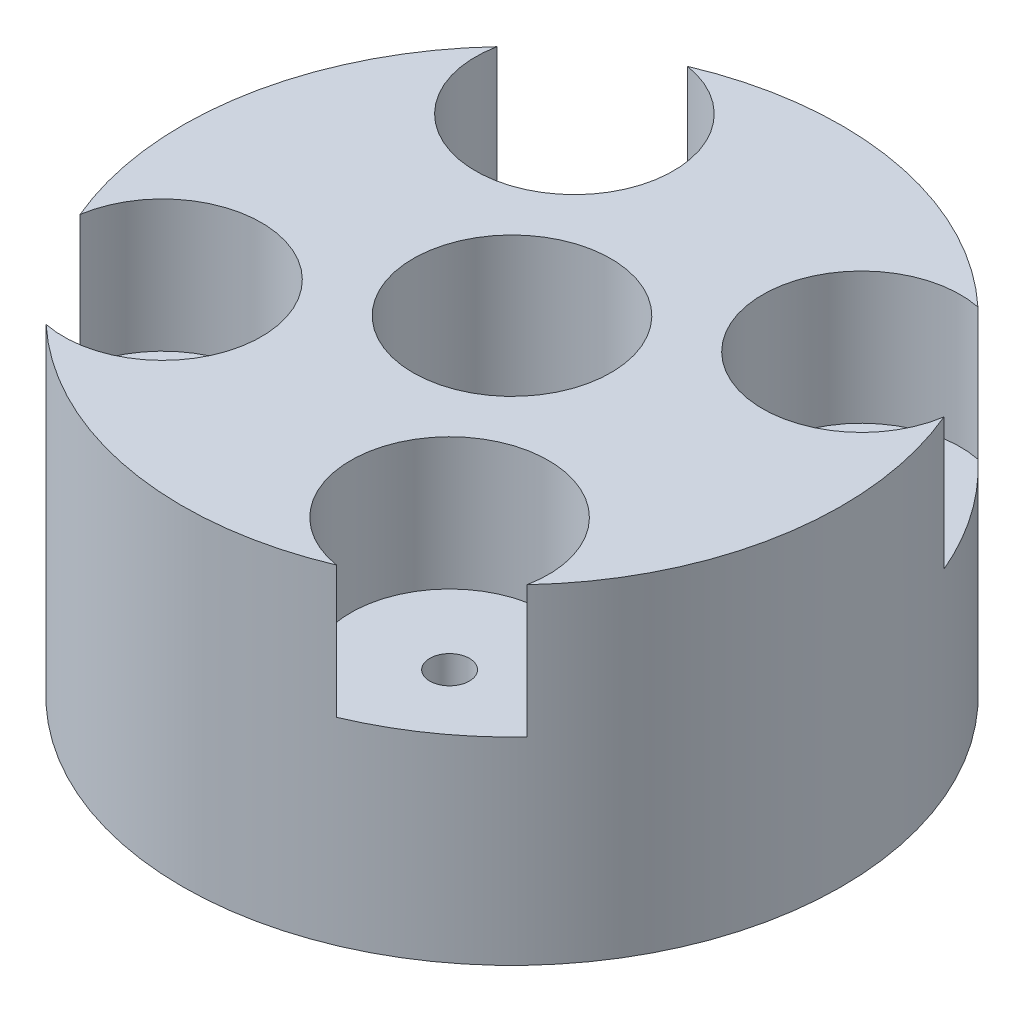
ISO-10303-21;
HEADER;
FILE_DESCRIPTION(('STEP AP214'),'2;1');
FILE_NAME('part.step','',(''),(''),'','','');
FILE_SCHEMA(('AUTOMOTIVE_DESIGN { 1 0 10303 214 1 1 1 1 }'));
ENDSEC;
DATA;
#1=APPLICATION_CONTEXT('core data for automotive mechanical design processes');
#2=APPLICATION_PROTOCOL_DEFINITION('international standard','automotive_design',2000,#1);
#3=PRODUCT_CONTEXT('',#1,'mechanical');
#4=PRODUCT('Part','Part','',(#3));
#5=PRODUCT_RELATED_PRODUCT_CATEGORY('part','',(#4));
#6=PRODUCT_DEFINITION_FORMATION('','',#4);
#7=PRODUCT_DEFINITION_CONTEXT('part definition',#1,'design');
#8=PRODUCT_DEFINITION('design','',#6,#7);
#9=PRODUCT_DEFINITION_SHAPE('','',#8);
#10=(LENGTH_UNIT() NAMED_UNIT(*) SI_UNIT(.MILLI.,.METRE.));
#11=(NAMED_UNIT(*) PLANE_ANGLE_UNIT() SI_UNIT($,.RADIAN.));
#12=(NAMED_UNIT(*) SI_UNIT($,.STERADIAN.) SOLID_ANGLE_UNIT());
#13=UNCERTAINTY_MEASURE_WITH_UNIT(LENGTH_MEASURE(1.E-05),#10,'distance_accuracy_value','');
#14=(GEOMETRIC_REPRESENTATION_CONTEXT(3) GLOBAL_UNCERTAINTY_ASSIGNED_CONTEXT((#13)) GLOBAL_UNIT_ASSIGNED_CONTEXT((#10,
#11,#12)) REPRESENTATION_CONTEXT('',''));
#15=CARTESIAN_POINT('',(0.,0.,0.));
#16=DIRECTION('',(0.,0.,1.));
#17=DIRECTION('',(1.,0.,0.));
#18=AXIS2_PLACEMENT_3D('',#15,#16,#17);
#19=CARTESIAN_POINT('',(-4.35465830228326,10.,-6.24795575131221));
#20=DIRECTION('',(0.,-1.,0.));
#21=DIRECTION('',(0.,0.,-1.));
#22=AXIS2_PLACEMENT_3D('',#19,#20,#21);
#23=CYLINDRICAL_SURFACE('',#22,0.599999999999987);
#24=CARTESIAN_POINT('',(-4.35465830228326,0.,-6.24795575131221));
#25=DIRECTION('',(0.,-1.,0.));
#26=DIRECTION('',(0.,0.,-1.));
#27=AXIS2_PLACEMENT_3D('',#24,#25,#26);
#28=CIRCLE('',#27,0.599999999999987);
#29=CARTESIAN_POINT('',(-4.35465830228326,0.,-6.8479557513122));
#30=VERTEX_POINT('',#29);
#31=EDGE_CURVE('E219',#30,#30,#28,.T.);
#32=ORIENTED_EDGE('',*,*,#31,.T.);
#33=EDGE_LOOP('',(#32));
#34=FACE_BOUND('',#33,.T.);
#35=CARTESIAN_POINT('',(-4.35465830228326,6.,-6.24795575131221));
#36=DIRECTION('',(0.,1.,0.));
#37=DIRECTION('',(0.,0.,1.));
#38=AXIS2_PLACEMENT_3D('',#35,#36,#37);
#39=CIRCLE('',#38,0.599999999999987);
#40=CARTESIAN_POINT('',(-4.35465830228326,6.,-5.64795575131222));
#41=VERTEX_POINT('',#40);
#42=EDGE_CURVE('E43',#41,#41,#39,.F.);
#43=ORIENTED_EDGE('',*,*,#42,.F.);
#44=EDGE_LOOP('',(#43));
#45=FACE_BOUND('',#44,.T.);
#46=ADVANCED_FACE('F39',(#34,#45),#23,.F.);
#47=CARTESIAN_POINT('',(4.35465830228322,10.,6.2479557513123));
#48=DIRECTION('',(0.,-1.,0.));
#49=DIRECTION('',(0.,0.,-1.));
#50=AXIS2_PLACEMENT_3D('',#47,#48,#49);
#51=CYLINDRICAL_SURFACE('',#50,0.599999999999999);
#52=CARTESIAN_POINT('',(4.35465830228322,0.,6.2479557513123));
#53=DIRECTION('',(0.,-1.,0.));
#54=DIRECTION('',(0.,0.,-1.));
#55=AXIS2_PLACEMENT_3D('',#52,#53,#54);
#56=CIRCLE('',#55,0.599999999999999);
#57=CARTESIAN_POINT('',(4.35465830228322,0.,5.6479557513123));
#58=VERTEX_POINT('',#57);
#59=EDGE_CURVE('E229',#58,#58,#56,.T.);
#60=ORIENTED_EDGE('',*,*,#59,.T.);
#61=EDGE_LOOP('',(#60));
#62=FACE_BOUND('',#61,.T.);
#63=CARTESIAN_POINT('',(4.35465830228322,6.,6.2479557513123));
#64=DIRECTION('',(0.,1.,0.));
#65=DIRECTION('',(0.,0.,1.));
#66=AXIS2_PLACEMENT_3D('',#63,#64,#65);
#67=CIRCLE('',#66,0.599999999999999);
#68=CARTESIAN_POINT('',(4.35465830228322,6.,6.8479557513123));
#69=VERTEX_POINT('',#68);
#70=EDGE_CURVE('E183',#69,#69,#67,.F.);
#71=ORIENTED_EDGE('',*,*,#70,.F.);
#72=EDGE_LOOP('',(#71));
#73=FACE_BOUND('',#72,.T.);
#74=ADVANCED_FACE('F314',(#62,#73),#51,.F.);
#75=CARTESIAN_POINT('',(6.24795575131227,10.,-4.35465830228322));
#76=DIRECTION('',(0.,-1.,0.));
#77=DIRECTION('',(0.,0.,-1.));
#78=AXIS2_PLACEMENT_3D('',#75,#76,#77);
#79=CYLINDRICAL_SURFACE('',#78,0.599999999999999);
#80=CARTESIAN_POINT('',(6.24795575131227,0.,-4.35465830228322));
#81=DIRECTION('',(0.,-1.,0.));
#82=DIRECTION('',(0.,0.,-1.));
#83=AXIS2_PLACEMENT_3D('',#80,#81,#82);
#84=CIRCLE('',#83,0.599999999999999);
#85=CARTESIAN_POINT('',(6.24795575131227,0.,-4.95465830228321));
#86=VERTEX_POINT('',#85);
#87=EDGE_CURVE('E226',#86,#86,#84,.T.);
#88=ORIENTED_EDGE('',*,*,#87,.T.);
#89=EDGE_LOOP('',(#88));
#90=FACE_BOUND('',#89,.T.);
#91=CARTESIAN_POINT('',(6.24795575131227,6.,-4.35465830228322));
#92=DIRECTION('',(0.,1.,0.));
#93=DIRECTION('',(0.,0.,1.));
#94=AXIS2_PLACEMENT_3D('',#91,#92,#93);
#95=CIRCLE('',#94,0.599999999999999);
#96=CARTESIAN_POINT('',(6.24795575131227,6.,-3.75465830228322));
#97=VERTEX_POINT('',#96);
#98=EDGE_CURVE('E180',#97,#97,#95,.F.);
#99=ORIENTED_EDGE('',*,*,#98,.F.);
#100=EDGE_LOOP('',(#99));
#101=FACE_BOUND('',#100,.T.);
#102=ADVANCED_FACE('F321',(#90,#101),#79,.F.);
#103=CARTESIAN_POINT('',(-6.24795575131223,10.,4.35465830228327));
#104=DIRECTION('',(0.,-1.,0.));
#105=DIRECTION('',(0.,0.,-1.));
#106=AXIS2_PLACEMENT_3D('',#103,#104,#105);
#107=CYLINDRICAL_SURFACE('',#106,0.599999999999999);
#108=CARTESIAN_POINT('',(-6.24795575131223,0.,4.35465830228327));
#109=DIRECTION('',(0.,-1.,0.));
#110=DIRECTION('',(0.,0.,-1.));
#111=AXIS2_PLACEMENT_3D('',#108,#109,#110);
#112=CIRCLE('',#111,0.599999999999999);
#113=CARTESIAN_POINT('',(-6.24795575131223,0.,3.75465830228327));
#114=VERTEX_POINT('',#113);
#115=EDGE_CURVE('E222',#114,#114,#112,.T.);
#116=ORIENTED_EDGE('',*,*,#115,.T.);
#117=EDGE_LOOP('',(#116));
#118=FACE_BOUND('',#117,.T.);
#119=CARTESIAN_POINT('',(-6.24795575131223,6.,4.35465830228327));
#120=DIRECTION('',(0.,1.,0.));
#121=DIRECTION('',(0.,0.,1.));
#122=AXIS2_PLACEMENT_3D('',#119,#120,#121);
#123=CIRCLE('',#122,0.599999999999999);
#124=CARTESIAN_POINT('',(-6.24795575131223,6.,4.95465830228327));
#125=VERTEX_POINT('',#124);
#126=EDGE_CURVE('E176',#125,#125,#123,.F.);
#127=ORIENTED_EDGE('',*,*,#126,.F.);
#128=EDGE_LOOP('',(#127));
#129=FACE_BOUND('',#128,.T.);
#130=ADVANCED_FACE('F347',(#118,#129),#107,.F.);
#131=CARTESIAN_POINT('',(0.,10.,0.));
#132=DIRECTION('',(0.,-1.,0.));
#133=DIRECTION('',(0.,0.,-1.));
#134=AXIS2_PLACEMENT_3D('',#131,#132,#133);
#135=CYLINDRICAL_SURFACE('',#134,10.);
#136=CARTESIAN_POINT('',(0.,6.,0.));
#137=DIRECTION('',(0.,1.,0.));
#138=DIRECTION('',(0.,0.,1.));
#139=AXIS2_PLACEMENT_3D('',#136,#137,#138);
#140=CIRCLE('',#139,10.);
#141=CARTESIAN_POINT('',(3.89107923847653,6.,9.21192175172461));
#142=VERTEX_POINT('',#141);
#143=CARTESIAN_POINT('',(7.29588777945787,6.,6.83886112664655));
#144=VERTEX_POINT('',#143);
#145=EDGE_CURVE('E185',#142,#144,#140,.T.);
#146=ORIENTED_EDGE('',*,*,#145,.F.);
#147=DIRECTION('',(0.,1.,0.));
#148=VECTOR('',#147,1.);
#149=CARTESIAN_POINT('',(3.89107923847653,8.,9.21192175172461));
#150=LINE('',#149,#148);
#151=CARTESIAN_POINT('',(3.89107923847653,10.,9.21192175172461));
#152=VERTEX_POINT('',#151);
#153=EDGE_CURVE('E212',#142,#152,#150,.T.);
#154=ORIENTED_EDGE('',*,*,#153,.T.);
#155=CARTESIAN_POINT('',(0.,10.,0.));
#156=DIRECTION('',(0.,1.,0.));
#157=DIRECTION('',(0.,0.,1.));
#158=AXIS2_PLACEMENT_3D('',#155,#156,#157);
#159=CIRCLE('',#158,10.);
#160=CARTESIAN_POINT('',(-6.83886112664649,10.,7.29588777945792));
#161=VERTEX_POINT('',#160);
#162=EDGE_CURVE('E50',#161,#152,#159,.T.);
#163=ORIENTED_EDGE('',*,*,#162,.F.);
#164=DIRECTION('',(0.,1.,0.));
#165=VECTOR('',#164,1.);
#166=CARTESIAN_POINT('',(-6.83886112664649,8.,7.29588777945792));
#167=LINE('',#166,#165);
#168=CARTESIAN_POINT('',(-6.8388611266465,6.,7.29588777945792));
#169=VERTEX_POINT('',#168);
#170=EDGE_CURVE('E57',#161,#169,#167,.F.);
#171=ORIENTED_EDGE('',*,*,#170,.T.);
#172=CARTESIAN_POINT('',(0.,6.,0.));
#173=DIRECTION('',(0.,1.,0.));
#174=DIRECTION('',(0.,0.,1.));
#175=AXIS2_PLACEMENT_3D('',#172,#173,#174);
#176=CIRCLE('',#175,10.);
#177=CARTESIAN_POINT('',(-9.21192175172455,6.,3.89107923847667));
#178=VERTEX_POINT('',#177);
#179=EDGE_CURVE('E160',#178,#169,#176,.T.);
#180=ORIENTED_EDGE('',*,*,#179,.F.);
#181=DIRECTION('',(0.,1.,0.));
#182=VECTOR('',#181,1.);
#183=CARTESIAN_POINT('',(-9.21192175172455,8.,3.89107923847666));
#184=LINE('',#183,#182);
#185=CARTESIAN_POINT('',(-9.21192175172455,10.,3.89107923847666));
#186=VERTEX_POINT('',#185);
#187=EDGE_CURVE('E145',#178,#186,#184,.T.);
#188=ORIENTED_EDGE('',*,*,#187,.T.);
#189=CARTESIAN_POINT('',(-7.2958877794579,10.,-6.83886112664652));
#190=VERTEX_POINT('',#189);
#191=EDGE_CURVE('E159',#190,#186,#159,.T.);
#192=ORIENTED_EDGE('',*,*,#191,.F.);
#193=DIRECTION('',(0.,1.,0.));
#194=VECTOR('',#193,1.);
#195=CARTESIAN_POINT('',(-7.2958877794579,8.,-6.83886112664652));
#196=LINE('',#195,#194);
#197=CARTESIAN_POINT('',(-7.2958877794579,6.,-6.83886112664652));
#198=VERTEX_POINT('',#197);
#199=EDGE_CURVE('E65',#190,#198,#196,.F.);
#200=ORIENTED_EDGE('',*,*,#199,.T.);
#201=CARTESIAN_POINT('',(0.,6.,0.));
#202=DIRECTION('',(0.,1.,0.));
#203=DIRECTION('',(0.,0.,1.));
#204=AXIS2_PLACEMENT_3D('',#201,#202,#203);
#205=CIRCLE('',#204,10.);
#206=CARTESIAN_POINT('',(-3.89107923847669,6.,-9.21192175172454));
#207=VERTEX_POINT('',#206);
#208=EDGE_CURVE('E197',#207,#198,#205,.T.);
#209=ORIENTED_EDGE('',*,*,#208,.F.);
#210=DIRECTION('',(0.,1.,0.));
#211=VECTOR('',#210,1.);
#212=CARTESIAN_POINT('',(-3.89107923847669,8.,-9.21192175172454));
#213=LINE('',#212,#211);
#214=CARTESIAN_POINT('',(-3.89107923847669,10.,-9.21192175172454));
#215=VERTEX_POINT('',#214);
#216=EDGE_CURVE('E206',#207,#215,#213,.T.);
#217=ORIENTED_EDGE('',*,*,#216,.T.);
#218=CARTESIAN_POINT('',(6.83886112664656,10.,-7.29588777945786));
#219=VERTEX_POINT('',#218);
#220=EDGE_CURVE('E48',#219,#215,#159,.T.);
#221=ORIENTED_EDGE('',*,*,#220,.F.);
#222=DIRECTION('',(0.,1.,0.));
#223=VECTOR('',#222,1.);
#224=CARTESIAN_POINT('',(6.83886112664656,8.,-7.29588777945786));
#225=LINE('',#224,#223);
#226=CARTESIAN_POINT('',(6.83886112664656,6.,-7.29588777945786));
#227=VERTEX_POINT('',#226);
#228=EDGE_CURVE('E199',#219,#227,#225,.F.);
#229=ORIENTED_EDGE('',*,*,#228,.T.);
#230=CARTESIAN_POINT('',(0.,6.,0.));
#231=DIRECTION('',(0.,1.,0.));
#232=DIRECTION('',(0.,0.,1.));
#233=AXIS2_PLACEMENT_3D('',#230,#231,#232);
#234=CIRCLE('',#233,10.);
#235=CARTESIAN_POINT('',(9.21192175172458,6.,-3.89107923847658));
#236=VERTEX_POINT('',#235);
#237=EDGE_CURVE('E182',#236,#227,#234,.T.);
#238=ORIENTED_EDGE('',*,*,#237,.F.);
#239=DIRECTION('',(0.,1.,0.));
#240=VECTOR('',#239,1.);
#241=CARTESIAN_POINT('',(9.21192175172458,8.,-3.89107923847658));
#242=LINE('',#241,#240);
#243=CARTESIAN_POINT('',(9.21192175172458,10.,-3.89107923847658));
#244=VERTEX_POINT('',#243);
#245=EDGE_CURVE('E202',#236,#244,#242,.T.);
#246=ORIENTED_EDGE('',*,*,#245,.T.);
#247=CARTESIAN_POINT('',(7.29588777945787,10.,6.83886112664655));
#248=VERTEX_POINT('',#247);
#249=EDGE_CURVE('E11',#248,#244,#159,.T.);
#250=ORIENTED_EDGE('',*,*,#249,.F.);
#251=DIRECTION('',(0.,1.,0.));
#252=VECTOR('',#251,1.);
#253=CARTESIAN_POINT('',(7.29588777945787,8.,6.83886112664655));
#254=LINE('',#253,#252);
#255=EDGE_CURVE('E161',#248,#144,#254,.F.);
#256=ORIENTED_EDGE('',*,*,#255,.T.);
#257=EDGE_LOOP('',(#146,#154,#163,#171,#180,#188,#192,#200,#209,#217,#221,#229,#238,#246,#250,#256));
#258=FACE_BOUND('',#257,.T.);
#259=CARTESIAN_POINT('',(0.,0.,0.));
#260=DIRECTION('',(0.,1.,0.));
#261=DIRECTION('',(0.,0.,1.));
#262=AXIS2_PLACEMENT_3D('',#259,#260,#261);
#263=CIRCLE('',#262,10.);
#264=CARTESIAN_POINT('',(0.,0.,10.));
#265=VERTEX_POINT('',#264);
#266=EDGE_CURVE('E168',#265,#265,#263,.T.);
#267=ORIENTED_EDGE('',*,*,#266,.T.);
#268=EDGE_LOOP('',(#267));
#269=FACE_BOUND('',#268,.T.);
#270=ADVANCED_FACE('F41',(#258,#269),#135,.T.);
#271=CARTESIAN_POINT('',(0.,10.,0.));
#272=DIRECTION('',(0.,1.,0.));
#273=DIRECTION('',(0.,0.,1.));
#274=AXIS2_PLACEMENT_3D('',#271,#272,#273);
#275=PLANE('',#274);
#276=CARTESIAN_POINT('',(4.35465830228322,10.,6.2479557513123));
#277=DIRECTION('',(0.,1.,0.));
#278=DIRECTION('',(0.,0.,1.));
#279=AXIS2_PLACEMENT_3D('',#276,#277,#278);
#280=CIRCLE('',#279,3.);
#281=EDGE_CURVE('E517',#248,#152,#280,.T.);
#282=ORIENTED_EDGE('',*,*,#281,.F.);
#283=ORIENTED_EDGE('',*,*,#249,.T.);
#284=CARTESIAN_POINT('',(6.24795575131227,10.,-4.35465830228322));
#285=DIRECTION('',(0.,1.,0.));
#286=DIRECTION('',(0.,0.,1.));
#287=AXIS2_PLACEMENT_3D('',#284,#285,#286);
#288=CIRCLE('',#287,3.);
#289=EDGE_CURVE('E513',#219,#244,#288,.T.);
#290=ORIENTED_EDGE('',*,*,#289,.F.);
#291=ORIENTED_EDGE('',*,*,#220,.T.);
#292=CARTESIAN_POINT('',(-4.35465830228326,10.,-6.24795575131221));
#293=DIRECTION('',(0.,1.,0.));
#294=DIRECTION('',(0.,0.,1.));
#295=AXIS2_PLACEMENT_3D('',#292,#293,#294);
#296=CIRCLE('',#295,3.);
#297=EDGE_CURVE('E167',#190,#215,#296,.T.);
#298=ORIENTED_EDGE('',*,*,#297,.F.);
#299=ORIENTED_EDGE('',*,*,#191,.T.);
#300=CARTESIAN_POINT('',(-6.24795575131223,10.,4.35465830228327));
#301=DIRECTION('',(0.,1.,0.));
#302=DIRECTION('',(0.,0.,1.));
#303=AXIS2_PLACEMENT_3D('',#300,#301,#302);
#304=CIRCLE('',#303,3.);
#305=EDGE_CURVE('E142',#161,#186,#304,.T.);
#306=ORIENTED_EDGE('',*,*,#305,.F.);
#307=ORIENTED_EDGE('',*,*,#162,.T.);
#308=EDGE_LOOP('',(#282,#283,#290,#291,#298,#299,#306,#307));
#309=FACE_BOUND('',#308,.T.);
#310=CARTESIAN_POINT('',(0.,10.,0.));
#311=DIRECTION('',(0.,1.,0.));
#312=DIRECTION('',(0.,0.,1.));
#313=AXIS2_PLACEMENT_3D('',#310,#311,#312);
#314=CIRCLE('',#313,3.);
#315=CARTESIAN_POINT('',(0.,10.,3.));
#316=VERTEX_POINT('',#315);
#317=EDGE_CURVE('E215',#316,#316,#314,.T.);
#318=ORIENTED_EDGE('',*,*,#317,.F.);
#319=EDGE_LOOP('',(#318));
#320=FACE_BOUND('',#319,.T.);
#321=ADVANCED_FACE('F164',(#309,#320),#275,.T.);
#322=CARTESIAN_POINT('',(0.,0.,0.));
#323=DIRECTION('',(0.,1.,0.));
#324=DIRECTION('',(0.,0.,1.));
#325=AXIS2_PLACEMENT_3D('',#322,#323,#324);
#326=PLANE('',#325);
#327=ORIENTED_EDGE('',*,*,#115,.F.);
#328=EDGE_LOOP('',(#327));
#329=FACE_BOUND('',#328,.T.);
#330=ORIENTED_EDGE('',*,*,#87,.F.);
#331=EDGE_LOOP('',(#330));
#332=FACE_BOUND('',#331,.T.);
#333=ORIENTED_EDGE('',*,*,#59,.F.);
#334=EDGE_LOOP('',(#333));
#335=FACE_BOUND('',#334,.T.);
#336=ORIENTED_EDGE('',*,*,#31,.F.);
#337=EDGE_LOOP('',(#336));
#338=FACE_BOUND('',#337,.T.);
#339=DIRECTION('',(-0.5,0.,0.866025403784439));
#340=VECTOR('',#339,1.);
#341=CARTESIAN_POINT('',(5.,0.,0.));
#342=LINE('',#341,#340);
#343=CARTESIAN_POINT('',(5.,0.,0.));
#344=VERTEX_POINT('',#343);
#345=CARTESIAN_POINT('',(2.5,0.,4.33012701892219));
#346=VERTEX_POINT('',#345);
#347=EDGE_CURVE('E254',#344,#346,#342,.T.);
#348=ORIENTED_EDGE('',*,*,#347,.F.);
#349=DIRECTION('',(0.5,0.,0.866025403784439));
#350=VECTOR('',#349,1.);
#351=CARTESIAN_POINT('',(2.5,0.,-4.33012701892219));
#352=LINE('',#351,#350);
#353=CARTESIAN_POINT('',(2.5,0.,-4.33012701892219));
#354=VERTEX_POINT('',#353);
#355=EDGE_CURVE('E225',#354,#344,#352,.T.);
#356=ORIENTED_EDGE('',*,*,#355,.F.);
#357=DIRECTION('',(1.,0.,0.));
#358=VECTOR('',#357,1.);
#359=CARTESIAN_POINT('',(-2.5,0.,-4.33012701892219));
#360=LINE('',#359,#358);
#361=CARTESIAN_POINT('',(-2.5,0.,-4.33012701892219));
#362=VERTEX_POINT('',#361);
#363=EDGE_CURVE('E238',#362,#354,#360,.T.);
#364=ORIENTED_EDGE('',*,*,#363,.F.);
#365=DIRECTION('',(0.5,0.,-0.866025403784439));
#366=VECTOR('',#365,1.);
#367=CARTESIAN_POINT('',(-5.,0.,0.));
#368=LINE('',#367,#366);
#369=CARTESIAN_POINT('',(-5.,0.,0.));
#370=VERTEX_POINT('',#369);
#371=EDGE_CURVE('E263',#370,#362,#368,.T.);
#372=ORIENTED_EDGE('',*,*,#371,.F.);
#373=DIRECTION('',(-0.5,0.,-0.866025403784439));
#374=VECTOR('',#373,1.);
#375=CARTESIAN_POINT('',(-2.5,0.,4.33012701892219));
#376=LINE('',#375,#374);
#377=CARTESIAN_POINT('',(-2.5,0.,4.33012701892219));
#378=VERTEX_POINT('',#377);
#379=EDGE_CURVE('E260',#378,#370,#376,.T.);
#380=ORIENTED_EDGE('',*,*,#379,.F.);
#381=DIRECTION('',(-1.,0.,0.));
#382=VECTOR('',#381,1.);
#383=CARTESIAN_POINT('',(2.5,0.,4.33012701892219));
#384=LINE('',#383,#382);
#385=EDGE_CURVE('E257',#346,#378,#384,.T.);
#386=ORIENTED_EDGE('',*,*,#385,.F.);
#387=EDGE_LOOP('',(#348,#356,#364,#372,#380,#386));
#388=FACE_BOUND('',#387,.T.);
#389=ORIENTED_EDGE('',*,*,#266,.F.);
#390=EDGE_LOOP('',(#389));
#391=FACE_BOUND('',#390,.T.);
#392=ADVANCED_FACE('F287',(#329,#332,#335,#338,#388,#391),#326,.F.);
#393=CARTESIAN_POINT('',(2.5,5.,-4.33012701892219));
#394=DIRECTION('',(0.866025403784439,0.,-0.5));
#395=DIRECTION('',(-0.5,0.,-0.866025403784439));
#396=AXIS2_PLACEMENT_3D('',#393,#394,#395);
#397=PLANE('',#396);
#398=ORIENTED_EDGE('',*,*,#355,.T.);
#399=DIRECTION('',(0.,-1.,0.));
#400=VECTOR('',#399,1.);
#401=CARTESIAN_POINT('',(5.,5.,0.));
#402=LINE('',#401,#400);
#403=CARTESIAN_POINT('',(5.,5.,0.));
#404=VERTEX_POINT('',#403);
#405=EDGE_CURVE('E171',#404,#344,#402,.T.);
#406=ORIENTED_EDGE('',*,*,#405,.F.);
#407=DIRECTION('',(0.5,0.,0.866025403784439));
#408=VECTOR('',#407,1.);
#409=CARTESIAN_POINT('',(2.5,5.,-4.33012701892219));
#410=LINE('',#409,#408);
#411=CARTESIAN_POINT('',(2.5,5.,-4.33012701892219));
#412=VERTEX_POINT('',#411);
#413=EDGE_CURVE('E234',#412,#404,#410,.T.);
#414=ORIENTED_EDGE('',*,*,#413,.F.);
#415=DIRECTION('',(0.,-1.,0.));
#416=VECTOR('',#415,1.);
#417=CARTESIAN_POINT('',(2.5,5.,-4.33012701892219));
#418=LINE('',#417,#416);
#419=EDGE_CURVE('E175',#412,#354,#418,.T.);
#420=ORIENTED_EDGE('',*,*,#419,.T.);
#421=EDGE_LOOP('',(#398,#406,#414,#420));
#422=FACE_BOUND('',#421,.T.);
#423=ADVANCED_FACE('F300',(#422),#397,.F.);
#424=CARTESIAN_POINT('',(-2.5,5.,-4.33012701892219));
#425=DIRECTION('',(0.,0.,-1.));
#426=DIRECTION('',(-1.,0.,0.));
#427=AXIS2_PLACEMENT_3D('',#424,#425,#426);
#428=PLANE('',#427);
#429=ORIENTED_EDGE('',*,*,#363,.T.);
#430=ORIENTED_EDGE('',*,*,#419,.F.);
#431=DIRECTION('',(1.,0.,0.));
#432=VECTOR('',#431,1.);
#433=CARTESIAN_POINT('',(-2.5,5.,-4.33012701892219));
#434=LINE('',#433,#432);
#435=CARTESIAN_POINT('',(-2.5,5.,-4.33012701892219));
#436=VERTEX_POINT('',#435);
#437=EDGE_CURVE('E250',#436,#412,#434,.T.);
#438=ORIENTED_EDGE('',*,*,#437,.F.);
#439=DIRECTION('',(0.,-1.,0.));
#440=VECTOR('',#439,1.);
#441=CARTESIAN_POINT('',(-2.5,5.,-4.33012701892219));
#442=LINE('',#441,#440);
#443=EDGE_CURVE('E269',#436,#362,#442,.T.);
#444=ORIENTED_EDGE('',*,*,#443,.T.);
#445=EDGE_LOOP('',(#429,#430,#438,#444));
#446=FACE_BOUND('',#445,.T.);
#447=ADVANCED_FACE('F302',(#446),#428,.F.);
#448=CARTESIAN_POINT('',(-5.,5.,0.));
#449=DIRECTION('',(-0.866025403784439,0.,-0.5));
#450=DIRECTION('',(-0.5,0.,0.866025403784439));
#451=AXIS2_PLACEMENT_3D('',#448,#449,#450);
#452=PLANE('',#451);
#453=ORIENTED_EDGE('',*,*,#371,.T.);
#454=ORIENTED_EDGE('',*,*,#443,.F.);
#455=DIRECTION('',(0.5,0.,-0.866025403784439));
#456=VECTOR('',#455,1.);
#457=CARTESIAN_POINT('',(-5.,5.,0.));
#458=LINE('',#457,#456);
#459=CARTESIAN_POINT('',(-5.,5.,0.));
#460=VERTEX_POINT('',#459);
#461=EDGE_CURVE('E247',#460,#436,#458,.T.);
#462=ORIENTED_EDGE('',*,*,#461,.F.);
#463=DIRECTION('',(0.,-1.,0.));
#464=VECTOR('',#463,1.);
#465=CARTESIAN_POINT('',(-5.,5.,0.));
#466=LINE('',#465,#464);
#467=EDGE_CURVE('E271',#460,#370,#466,.T.);
#468=ORIENTED_EDGE('',*,*,#467,.T.);
#469=EDGE_LOOP('',(#453,#454,#462,#468));
#470=FACE_BOUND('',#469,.T.);
#471=ADVANCED_FACE('F304',(#470),#452,.F.);
#472=CARTESIAN_POINT('',(-2.5,5.,4.33012701892219));
#473=DIRECTION('',(-0.866025403784439,0.,0.5));
#474=DIRECTION('',(0.5,0.,0.866025403784439));
#475=AXIS2_PLACEMENT_3D('',#472,#473,#474);
#476=PLANE('',#475);
#477=ORIENTED_EDGE('',*,*,#379,.T.);
#478=ORIENTED_EDGE('',*,*,#467,.F.);
#479=DIRECTION('',(-0.5,0.,-0.866025403784439));
#480=VECTOR('',#479,1.);
#481=CARTESIAN_POINT('',(-2.5,5.,4.33012701892219));
#482=LINE('',#481,#480);
#483=CARTESIAN_POINT('',(-2.5,5.,4.33012701892219));
#484=VERTEX_POINT('',#483);
#485=EDGE_CURVE('E244',#484,#460,#482,.T.);
#486=ORIENTED_EDGE('',*,*,#485,.F.);
#487=DIRECTION('',(0.,-1.,0.));
#488=VECTOR('',#487,1.);
#489=CARTESIAN_POINT('',(-2.5,5.,4.33012701892219));
#490=LINE('',#489,#488);
#491=EDGE_CURVE('E273',#484,#378,#490,.T.);
#492=ORIENTED_EDGE('',*,*,#491,.T.);
#493=EDGE_LOOP('',(#477,#478,#486,#492));
#494=FACE_BOUND('',#493,.T.);
#495=ADVANCED_FACE('F295',(#494),#476,.F.);
#496=CARTESIAN_POINT('',(2.5,5.,4.33012701892219));
#497=DIRECTION('',(0.,0.,1.));
#498=DIRECTION('',(1.,0.,0.));
#499=AXIS2_PLACEMENT_3D('',#496,#497,#498);
#500=PLANE('',#499);
#501=ORIENTED_EDGE('',*,*,#385,.T.);
#502=ORIENTED_EDGE('',*,*,#491,.F.);
#503=DIRECTION('',(-1.,0.,0.));
#504=VECTOR('',#503,1.);
#505=CARTESIAN_POINT('',(2.5,5.,4.33012701892219));
#506=LINE('',#505,#504);
#507=CARTESIAN_POINT('',(2.5,5.,4.33012701892219));
#508=VERTEX_POINT('',#507);
#509=EDGE_CURVE('E241',#508,#484,#506,.T.);
#510=ORIENTED_EDGE('',*,*,#509,.F.);
#511=DIRECTION('',(0.,-1.,0.));
#512=VECTOR('',#511,1.);
#513=CARTESIAN_POINT('',(2.5,5.,4.33012701892219));
#514=LINE('',#513,#512);
#515=EDGE_CURVE('E274',#508,#346,#514,.T.);
#516=ORIENTED_EDGE('',*,*,#515,.T.);
#517=EDGE_LOOP('',(#501,#502,#510,#516));
#518=FACE_BOUND('',#517,.T.);
#519=ADVANCED_FACE('F292',(#518),#500,.F.);
#520=CARTESIAN_POINT('',(5.,5.,0.));
#521=DIRECTION('',(0.866025403784439,0.,0.5));
#522=DIRECTION('',(0.5,0.,-0.866025403784439));
#523=AXIS2_PLACEMENT_3D('',#520,#521,#522);
#524=PLANE('',#523);
#525=ORIENTED_EDGE('',*,*,#347,.T.);
#526=ORIENTED_EDGE('',*,*,#515,.F.);
#527=DIRECTION('',(-0.5,0.,0.866025403784439));
#528=VECTOR('',#527,1.);
#529=CARTESIAN_POINT('',(5.,5.,0.));
#530=LINE('',#529,#528);
#531=EDGE_CURVE('E237',#404,#508,#530,.T.);
#532=ORIENTED_EDGE('',*,*,#531,.F.);
#533=ORIENTED_EDGE('',*,*,#405,.T.);
#534=EDGE_LOOP('',(#525,#526,#532,#533));
#535=FACE_BOUND('',#534,.T.);
#536=ADVANCED_FACE('F281',(#535),#524,.F.);
#537=CARTESIAN_POINT('',(0.,5.,0.));
#538=DIRECTION('',(0.,-1.,0.));
#539=DIRECTION('',(0.,0.,-1.));
#540=AXIS2_PLACEMENT_3D('',#537,#538,#539);
#541=PLANE('',#540);
#542=CARTESIAN_POINT('',(0.,5.,0.));
#543=DIRECTION('',(0.,1.,0.));
#544=DIRECTION('',(0.,0.,1.));
#545=AXIS2_PLACEMENT_3D('',#542,#543,#544);
#546=CIRCLE('',#545,3.);
#547=CARTESIAN_POINT('',(0.,5.,3.));
#548=VERTEX_POINT('',#547);
#549=EDGE_CURVE('E216',#548,#548,#546,.T.);
#550=ORIENTED_EDGE('',*,*,#549,.T.);
#551=EDGE_LOOP('',(#550));
#552=FACE_BOUND('',#551,.T.);
#553=ORIENTED_EDGE('',*,*,#413,.T.);
#554=ORIENTED_EDGE('',*,*,#531,.T.);
#555=ORIENTED_EDGE('',*,*,#509,.T.);
#556=ORIENTED_EDGE('',*,*,#485,.T.);
#557=ORIENTED_EDGE('',*,*,#461,.T.);
#558=ORIENTED_EDGE('',*,*,#437,.T.);
#559=EDGE_LOOP('',(#553,#554,#555,#556,#557,#558));
#560=FACE_BOUND('',#559,.T.);
#561=ADVANCED_FACE('F298',(#552,#560),#541,.T.);
#562=CARTESIAN_POINT('',(0.,5.,0.));
#563=DIRECTION('',(0.,1.,0.));
#564=DIRECTION('',(0.,0.,1.));
#565=AXIS2_PLACEMENT_3D('',#562,#563,#564);
#566=CYLINDRICAL_SURFACE('',#565,3.);
#567=ORIENTED_EDGE('',*,*,#549,.F.);
#568=EDGE_LOOP('',(#567));
#569=FACE_BOUND('',#568,.T.);
#570=ORIENTED_EDGE('',*,*,#317,.T.);
#571=EDGE_LOOP('',(#570));
#572=FACE_BOUND('',#571,.T.);
#573=ADVANCED_FACE('F328',(#569,#572),#566,.F.);
#574=CARTESIAN_POINT('',(-6.24795575131223,6.,4.35465830228327));
#575=DIRECTION('',(0.,1.,0.));
#576=DIRECTION('',(0.,0.,1.));
#577=AXIS2_PLACEMENT_3D('',#574,#575,#576);
#578=CYLINDRICAL_SURFACE('',#577,3.);
#579=CARTESIAN_POINT('',(-6.24795575131223,6.,4.35465830228327));
#580=DIRECTION('',(0.,1.,0.));
#581=DIRECTION('',(0.,0.,1.));
#582=AXIS2_PLACEMENT_3D('',#579,#580,#581);
#583=CIRCLE('',#582,3.);
#584=EDGE_CURVE('E152',#169,#178,#583,.T.);
#585=ORIENTED_EDGE('',*,*,#584,.F.);
#586=ORIENTED_EDGE('',*,*,#170,.F.);
#587=ORIENTED_EDGE('',*,*,#305,.T.);
#588=ORIENTED_EDGE('',*,*,#187,.F.);
#589=EDGE_LOOP('',(#585,#586,#587,#588));
#590=FACE_BOUND('',#589,.T.);
#591=ADVANCED_FACE('F144',(#590),#578,.F.);
#592=CARTESIAN_POINT('',(-6.24795575131223,6.,4.35465830228327));
#593=DIRECTION('',(0.,1.,0.));
#594=DIRECTION('',(0.,0.,1.));
#595=AXIS2_PLACEMENT_3D('',#592,#593,#594);
#596=PLANE('',#595);
#597=ORIENTED_EDGE('',*,*,#126,.T.);
#598=EDGE_LOOP('',(#597));
#599=FACE_BOUND('',#598,.T.);
#600=ORIENTED_EDGE('',*,*,#179,.T.);
#601=ORIENTED_EDGE('',*,*,#584,.T.);
#602=EDGE_LOOP('',(#600,#601));
#603=FACE_BOUND('',#602,.T.);
#604=ADVANCED_FACE('F436',(#599,#603),#596,.T.);
#605=CARTESIAN_POINT('',(6.24795575131227,6.,-4.35465830228322));
#606=DIRECTION('',(0.,1.,0.));
#607=DIRECTION('',(0.,0.,1.));
#608=AXIS2_PLACEMENT_3D('',#605,#606,#607);
#609=CYLINDRICAL_SURFACE('',#608,3.);
#610=CARTESIAN_POINT('',(6.24795575131227,6.,-4.35465830228322));
#611=DIRECTION('',(0.,1.,0.));
#612=DIRECTION('',(0.,0.,1.));
#613=AXIS2_PLACEMENT_3D('',#610,#611,#612);
#614=CIRCLE('',#613,3.);
#615=EDGE_CURVE('E179',#227,#236,#614,.T.);
#616=ORIENTED_EDGE('',*,*,#615,.F.);
#617=ORIENTED_EDGE('',*,*,#228,.F.);
#618=ORIENTED_EDGE('',*,*,#289,.T.);
#619=ORIENTED_EDGE('',*,*,#245,.F.);
#620=EDGE_LOOP('',(#616,#617,#618,#619));
#621=FACE_BOUND('',#620,.T.);
#622=ADVANCED_FACE('F444',(#621),#609,.F.);
#623=CARTESIAN_POINT('',(6.24795575131227,6.,-4.35465830228322));
#624=DIRECTION('',(0.,1.,0.));
#625=DIRECTION('',(0.,0.,1.));
#626=AXIS2_PLACEMENT_3D('',#623,#624,#625);
#627=PLANE('',#626);
#628=ORIENTED_EDGE('',*,*,#98,.T.);
#629=EDGE_LOOP('',(#628));
#630=FACE_BOUND('',#629,.T.);
#631=ORIENTED_EDGE('',*,*,#237,.T.);
#632=ORIENTED_EDGE('',*,*,#615,.T.);
#633=EDGE_LOOP('',(#631,#632));
#634=FACE_BOUND('',#633,.T.);
#635=ADVANCED_FACE('F453',(#630,#634),#627,.T.);
#636=CARTESIAN_POINT('',(4.35465830228322,6.,6.2479557513123));
#637=DIRECTION('',(0.,1.,0.));
#638=DIRECTION('',(0.,0.,1.));
#639=AXIS2_PLACEMENT_3D('',#636,#637,#638);
#640=CYLINDRICAL_SURFACE('',#639,3.);
#641=CARTESIAN_POINT('',(4.35465830228322,6.,6.2479557513123));
#642=DIRECTION('',(0.,1.,0.));
#643=DIRECTION('',(0.,0.,1.));
#644=AXIS2_PLACEMENT_3D('',#641,#642,#643);
#645=CIRCLE('',#644,3.);
#646=EDGE_CURVE('E519',#144,#142,#645,.T.);
#647=ORIENTED_EDGE('',*,*,#646,.F.);
#648=ORIENTED_EDGE('',*,*,#255,.F.);
#649=ORIENTED_EDGE('',*,*,#281,.T.);
#650=ORIENTED_EDGE('',*,*,#153,.F.);
#651=EDGE_LOOP('',(#647,#648,#649,#650));
#652=FACE_BOUND('',#651,.T.);
#653=ADVANCED_FACE('F462',(#652),#640,.F.);
#654=CARTESIAN_POINT('',(4.35465830228322,6.,6.2479557513123));
#655=DIRECTION('',(0.,1.,0.));
#656=DIRECTION('',(0.,0.,1.));
#657=AXIS2_PLACEMENT_3D('',#654,#655,#656);
#658=PLANE('',#657);
#659=ORIENTED_EDGE('',*,*,#70,.T.);
#660=EDGE_LOOP('',(#659));
#661=FACE_BOUND('',#660,.T.);
#662=ORIENTED_EDGE('',*,*,#145,.T.);
#663=ORIENTED_EDGE('',*,*,#646,.T.);
#664=EDGE_LOOP('',(#662,#663));
#665=FACE_BOUND('',#664,.T.);
#666=ADVANCED_FACE('F471',(#661,#665),#658,.T.);
#667=CARTESIAN_POINT('',(-4.35465830228326,6.,-6.24795575131221));
#668=DIRECTION('',(0.,1.,0.));
#669=DIRECTION('',(0.,0.,1.));
#670=AXIS2_PLACEMENT_3D('',#667,#668,#669);
#671=CYLINDRICAL_SURFACE('',#670,3.);
#672=CARTESIAN_POINT('',(-4.35465830228326,6.,-6.24795575131221));
#673=DIRECTION('',(0.,1.,0.));
#674=DIRECTION('',(0.,0.,1.));
#675=AXIS2_PLACEMENT_3D('',#672,#673,#674);
#676=CIRCLE('',#675,3.);
#677=EDGE_CURVE('E151',#198,#207,#676,.T.);
#678=ORIENTED_EDGE('',*,*,#677,.F.);
#679=ORIENTED_EDGE('',*,*,#199,.F.);
#680=ORIENTED_EDGE('',*,*,#297,.T.);
#681=ORIENTED_EDGE('',*,*,#216,.F.);
#682=EDGE_LOOP('',(#678,#679,#680,#681));
#683=FACE_BOUND('',#682,.T.);
#684=ADVANCED_FACE('F480',(#683),#671,.F.);
#685=CARTESIAN_POINT('',(-4.35465830228326,6.,-6.24795575131221));
#686=DIRECTION('',(0.,1.,0.));
#687=DIRECTION('',(0.,0.,1.));
#688=AXIS2_PLACEMENT_3D('',#685,#686,#687);
#689=PLANE('',#688);
#690=ORIENTED_EDGE('',*,*,#42,.T.);
#691=EDGE_LOOP('',(#690));
#692=FACE_BOUND('',#691,.T.);
#693=ORIENTED_EDGE('',*,*,#208,.T.);
#694=ORIENTED_EDGE('',*,*,#677,.T.);
#695=EDGE_LOOP('',(#693,#694));
#696=FACE_BOUND('',#695,.T.);
#697=ADVANCED_FACE('F488',(#692,#696),#689,.T.);
#698=CLOSED_SHELL('',(#46,#74,#102,#130,#270,#321,#392,#423,#447,#471,#495,#519,#536,#561,#573,
#591,#604,#622,#635,#653,#666,#684,#697));
#699=MANIFOLD_SOLID_BREP('B2',#698);
#700=ADVANCED_BREP_SHAPE_REPRESENTATION('',(#18,#699),#14);
#701=SHAPE_DEFINITION_REPRESENTATION(#9,#700);
ENDSEC;
END-ISO-10303-21;
